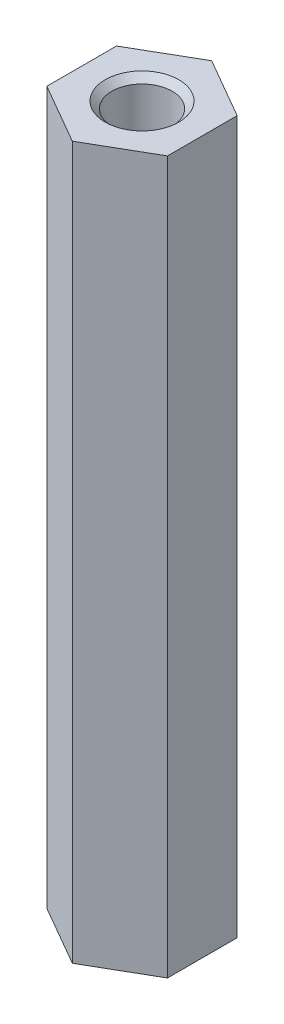
ISO-10303-21;
HEADER;
FILE_DESCRIPTION(('STEP AP214'),'2;1');
FILE_NAME('part.step','',(''),(''),'','','');
FILE_SCHEMA(('AUTOMOTIVE_DESIGN { 1 0 10303 214 1 1 1 1 }'));
ENDSEC;
DATA;
#1=APPLICATION_CONTEXT('core data for automotive mechanical design processes');
#2=APPLICATION_PROTOCOL_DEFINITION('international standard','automotive_design',2000,#1);
#3=PRODUCT_CONTEXT('',#1,'mechanical');
#4=PRODUCT('Part','Part','',(#3));
#5=PRODUCT_RELATED_PRODUCT_CATEGORY('part','',(#4));
#6=PRODUCT_DEFINITION_FORMATION('','',#4);
#7=PRODUCT_DEFINITION_CONTEXT('part definition',#1,'design');
#8=PRODUCT_DEFINITION('design','',#6,#7);
#9=PRODUCT_DEFINITION_SHAPE('','',#8);
#10=(LENGTH_UNIT() NAMED_UNIT(*) SI_UNIT(.MILLI.,.METRE.));
#11=(NAMED_UNIT(*) PLANE_ANGLE_UNIT() SI_UNIT($,.RADIAN.));
#12=(NAMED_UNIT(*) SI_UNIT($,.STERADIAN.) SOLID_ANGLE_UNIT());
#13=UNCERTAINTY_MEASURE_WITH_UNIT(LENGTH_MEASURE(1.E-05),#10,'distance_accuracy_value','');
#14=(GEOMETRIC_REPRESENTATION_CONTEXT(3) GLOBAL_UNCERTAINTY_ASSIGNED_CONTEXT((#13)) GLOBAL_UNIT_ASSIGNED_CONTEXT((#10,
#11,#12)) REPRESENTATION_CONTEXT('',''));
#15=CARTESIAN_POINT('',(0.,0.,0.));
#16=DIRECTION('',(0.,0.,1.));
#17=DIRECTION('',(1.,0.,0.));
#18=AXIS2_PLACEMENT_3D('',#15,#16,#17);
#19=CARTESIAN_POINT('',(0.,29.5,-2.88675134594813));
#20=DIRECTION('',(0.5,0.,0.866025403784439));
#21=DIRECTION('',(0.866025403784439,0.,-0.5));
#22=AXIS2_PLACEMENT_3D('',#19,#20,#21);
#23=PLANE('',#22);
#24=DIRECTION('',(-0.866025403784439,0.,0.5));
#25=VECTOR('',#24,1.);
#26=CARTESIAN_POINT('',(0.,0.,-2.88675134594813));
#27=LINE('',#26,#25);
#28=CARTESIAN_POINT('',(0.,0.,-2.88675134594813));
#29=VERTEX_POINT('',#28);
#30=CARTESIAN_POINT('',(-2.5,0.,-1.44337567297407));
#31=VERTEX_POINT('',#30);
#32=EDGE_CURVE('E129',#29,#31,#27,.T.);
#33=ORIENTED_EDGE('',*,*,#32,.T.);
#34=DIRECTION('',(0.,-1.,0.));
#35=VECTOR('',#34,1.);
#36=CARTESIAN_POINT('',(-2.5,29.5,-1.44337567297407));
#37=LINE('',#36,#35);
#38=CARTESIAN_POINT('',(-2.5,29.5,-1.44337567297407));
#39=VERTEX_POINT('',#38);
#40=EDGE_CURVE('E11',#39,#31,#37,.T.);
#41=ORIENTED_EDGE('',*,*,#40,.F.);
#42=DIRECTION('',(-0.866025403784439,0.,0.5));
#43=VECTOR('',#42,1.);
#44=CARTESIAN_POINT('',(0.,29.5,-2.88675134594813));
#45=LINE('',#44,#43);
#46=CARTESIAN_POINT('',(0.,29.5,-2.88675134594813));
#47=VERTEX_POINT('',#46);
#48=EDGE_CURVE('E140',#47,#39,#45,.T.);
#49=ORIENTED_EDGE('',*,*,#48,.F.);
#50=DIRECTION('',(0.,-1.,0.));
#51=VECTOR('',#50,1.);
#52=CARTESIAN_POINT('',(0.,29.5,-2.88675134594813));
#53=LINE('',#52,#51);
#54=EDGE_CURVE('E125',#47,#29,#53,.T.);
#55=ORIENTED_EDGE('',*,*,#54,.T.);
#56=EDGE_LOOP('',(#33,#41,#49,#55));
#57=FACE_BOUND('',#56,.T.);
#58=ADVANCED_FACE('F42',(#57),#23,.F.);
#59=CARTESIAN_POINT('',(-2.5,29.5,-1.44337567297407));
#60=DIRECTION('',(1.,0.,0.));
#61=DIRECTION('',(0.,0.,-1.));
#62=AXIS2_PLACEMENT_3D('',#59,#60,#61);
#63=PLANE('',#62);
#64=DIRECTION('',(0.,0.,1.));
#65=VECTOR('',#64,1.);
#66=CARTESIAN_POINT('',(-2.5,0.,-1.44337567297407));
#67=LINE('',#66,#65);
#68=CARTESIAN_POINT('',(-2.5,0.,1.44337567297406));
#69=VERTEX_POINT('',#68);
#70=EDGE_CURVE('E132',#31,#69,#67,.T.);
#71=ORIENTED_EDGE('',*,*,#70,.T.);
#72=DIRECTION('',(0.,-1.,0.));
#73=VECTOR('',#72,1.);
#74=CARTESIAN_POINT('',(-2.5,29.5,1.44337567297406));
#75=LINE('',#74,#73);
#76=CARTESIAN_POINT('',(-2.5,29.5,1.44337567297406));
#77=VERTEX_POINT('',#76);
#78=EDGE_CURVE('E50',#77,#69,#75,.T.);
#79=ORIENTED_EDGE('',*,*,#78,.F.);
#80=DIRECTION('',(0.,0.,1.));
#81=VECTOR('',#80,1.);
#82=CARTESIAN_POINT('',(-2.5,29.5,-1.44337567297407));
#83=LINE('',#82,#81);
#84=EDGE_CURVE('E96',#39,#77,#83,.T.);
#85=ORIENTED_EDGE('',*,*,#84,.F.);
#86=ORIENTED_EDGE('',*,*,#40,.T.);
#87=EDGE_LOOP('',(#71,#79,#85,#86));
#88=FACE_BOUND('',#87,.T.);
#89=ADVANCED_FACE('F165',(#88),#63,.F.);
#90=CARTESIAN_POINT('',(-2.5,29.5,1.44337567297406));
#91=DIRECTION('',(0.5,0.,-0.866025403784438));
#92=DIRECTION('',(-0.866025403784439,0.,-0.5));
#93=AXIS2_PLACEMENT_3D('',#90,#91,#92);
#94=PLANE('',#93);
#95=DIRECTION('',(0.866025403784438,0.,0.5));
#96=VECTOR('',#95,1.);
#97=CARTESIAN_POINT('',(-2.5,0.,1.44337567297406));
#98=LINE('',#97,#96);
#99=CARTESIAN_POINT('',(0.,0.,2.88675134594813));
#100=VERTEX_POINT('',#99);
#101=EDGE_CURVE('E135',#69,#100,#98,.T.);
#102=ORIENTED_EDGE('',*,*,#101,.T.);
#103=DIRECTION('',(0.,-1.,0.));
#104=VECTOR('',#103,1.);
#105=CARTESIAN_POINT('',(0.,29.5,2.88675134594813));
#106=LINE('',#105,#104);
#107=CARTESIAN_POINT('',(0.,29.5,2.88675134594813));
#108=VERTEX_POINT('',#107);
#109=EDGE_CURVE('E120',#108,#100,#106,.T.);
#110=ORIENTED_EDGE('',*,*,#109,.F.);
#111=DIRECTION('',(0.866025403784438,0.,0.5));
#112=VECTOR('',#111,1.);
#113=CARTESIAN_POINT('',(-2.5,29.5,1.44337567297406));
#114=LINE('',#113,#112);
#115=EDGE_CURVE('E111',#77,#108,#114,.T.);
#116=ORIENTED_EDGE('',*,*,#115,.F.);
#117=ORIENTED_EDGE('',*,*,#78,.T.);
#118=EDGE_LOOP('',(#102,#110,#116,#117));
#119=FACE_BOUND('',#118,.T.);
#120=ADVANCED_FACE('F146',(#119),#94,.F.);
#121=CARTESIAN_POINT('',(0.,29.5,2.88675134594813));
#122=DIRECTION('',(-0.5,0.,-0.866025403784439));
#123=DIRECTION('',(-0.866025403784439,0.,0.5));
#124=AXIS2_PLACEMENT_3D('',#121,#122,#123);
#125=PLANE('',#124);
#126=DIRECTION('',(0.866025403784438,0.,-0.5));
#127=VECTOR('',#126,1.);
#128=CARTESIAN_POINT('',(0.,0.,2.88675134594813));
#129=LINE('',#128,#127);
#130=CARTESIAN_POINT('',(2.5,0.,1.44337567297406));
#131=VERTEX_POINT('',#130);
#132=EDGE_CURVE('E119',#100,#131,#129,.T.);
#133=ORIENTED_EDGE('',*,*,#132,.T.);
#134=DIRECTION('',(0.,-1.,0.));
#135=VECTOR('',#134,1.);
#136=CARTESIAN_POINT('',(2.5,29.5,1.44337567297406));
#137=LINE('',#136,#135);
#138=CARTESIAN_POINT('',(2.5,29.5,1.44337567297406));
#139=VERTEX_POINT('',#138);
#140=EDGE_CURVE('E116',#139,#131,#137,.T.);
#141=ORIENTED_EDGE('',*,*,#140,.F.);
#142=DIRECTION('',(0.866025403784438,0.,-0.5));
#143=VECTOR('',#142,1.);
#144=CARTESIAN_POINT('',(0.,29.5,2.88675134594813));
#145=LINE('',#144,#143);
#146=EDGE_CURVE('E105',#108,#139,#145,.T.);
#147=ORIENTED_EDGE('',*,*,#146,.F.);
#148=ORIENTED_EDGE('',*,*,#109,.T.);
#149=EDGE_LOOP('',(#133,#141,#147,#148));
#150=FACE_BOUND('',#149,.T.);
#151=ADVANCED_FACE('F117',(#150),#125,.F.);
#152=CARTESIAN_POINT('',(2.5,29.5,1.44337567297406));
#153=DIRECTION('',(-1.,0.,0.));
#154=DIRECTION('',(0.,0.,1.));
#155=AXIS2_PLACEMENT_3D('',#152,#153,#154);
#156=PLANE('',#155);
#157=DIRECTION('',(0.,0.,-1.));
#158=VECTOR('',#157,1.);
#159=CARTESIAN_POINT('',(2.5,0.,1.44337567297406));
#160=LINE('',#159,#158);
#161=CARTESIAN_POINT('',(2.5,0.,-1.44337567297407));
#162=VERTEX_POINT('',#161);
#163=EDGE_CURVE('E82',#131,#162,#160,.T.);
#164=ORIENTED_EDGE('',*,*,#163,.T.);
#165=DIRECTION('',(0.,-1.,0.));
#166=VECTOR('',#165,1.);
#167=CARTESIAN_POINT('',(2.5,29.5,-1.44337567297407));
#168=LINE('',#167,#166);
#169=CARTESIAN_POINT('',(2.5,29.5,-1.44337567297407));
#170=VERTEX_POINT('',#169);
#171=EDGE_CURVE('E121',#170,#162,#168,.T.);
#172=ORIENTED_EDGE('',*,*,#171,.F.);
#173=DIRECTION('',(0.,0.,-1.));
#174=VECTOR('',#173,1.);
#175=CARTESIAN_POINT('',(2.5,29.5,1.44337567297406));
#176=LINE('',#175,#174);
#177=EDGE_CURVE('E109',#139,#170,#176,.T.);
#178=ORIENTED_EDGE('',*,*,#177,.F.);
#179=ORIENTED_EDGE('',*,*,#140,.T.);
#180=EDGE_LOOP('',(#164,#172,#178,#179));
#181=FACE_BOUND('',#180,.T.);
#182=ADVANCED_FACE('F123',(#181),#156,.F.);
#183=CARTESIAN_POINT('',(2.5,29.5,-1.44337567297407));
#184=DIRECTION('',(-0.5,0.,0.866025403784438));
#185=DIRECTION('',(0.866025403784439,0.,0.5));
#186=AXIS2_PLACEMENT_3D('',#183,#184,#185);
#187=PLANE('',#186);
#188=DIRECTION('',(-0.866025403784439,0.,-0.5));
#189=VECTOR('',#188,1.);
#190=CARTESIAN_POINT('',(2.5,0.,-1.44337567297407));
#191=LINE('',#190,#189);
#192=EDGE_CURVE('E88',#162,#29,#191,.T.);
#193=ORIENTED_EDGE('',*,*,#192,.T.);
#194=ORIENTED_EDGE('',*,*,#54,.F.);
#195=DIRECTION('',(-0.866025403784439,0.,-0.5));
#196=VECTOR('',#195,1.);
#197=CARTESIAN_POINT('',(2.5,29.5,-1.44337567297407));
#198=LINE('',#197,#196);
#199=EDGE_CURVE('E58',#170,#47,#198,.T.);
#200=ORIENTED_EDGE('',*,*,#199,.F.);
#201=ORIENTED_EDGE('',*,*,#171,.T.);
#202=EDGE_LOOP('',(#193,#194,#200,#201));
#203=FACE_BOUND('',#202,.T.);
#204=ADVANCED_FACE('F153',(#203),#187,.F.);
#205=CARTESIAN_POINT('',(0.,29.5,0.));
#206=DIRECTION('',(0.,1.,0.));
#207=DIRECTION('',(0.,0.,1.));
#208=AXIS2_PLACEMENT_3D('',#205,#206,#207);
#209=PLANE('',#208);
#210=CARTESIAN_POINT('',(0.,29.5,0.));
#211=DIRECTION('',(0.,1.,0.));
#212=DIRECTION('',(0.,0.,1.));
#213=AXIS2_PLACEMENT_3D('',#210,#211,#212);
#214=CIRCLE('',#213,1.525);
#215=CARTESIAN_POINT('',(0.,29.5,1.525));
#216=VERTEX_POINT('',#215);
#217=EDGE_CURVE('E294',#216,#216,#214,.T.);
#218=ORIENTED_EDGE('',*,*,#217,.F.);
#219=EDGE_LOOP('',(#218));
#220=FACE_BOUND('',#219,.T.);
#221=ORIENTED_EDGE('',*,*,#48,.T.);
#222=ORIENTED_EDGE('',*,*,#84,.T.);
#223=ORIENTED_EDGE('',*,*,#115,.T.);
#224=ORIENTED_EDGE('',*,*,#146,.T.);
#225=ORIENTED_EDGE('',*,*,#177,.T.);
#226=ORIENTED_EDGE('',*,*,#199,.T.);
#227=EDGE_LOOP('',(#221,#222,#223,#224,#225,#226));
#228=FACE_BOUND('',#227,.T.);
#229=ADVANCED_FACE('F107',(#220,#228),#209,.T.);
#230=CARTESIAN_POINT('',(0.,0.,0.));
#231=DIRECTION('',(0.,1.,0.));
#232=DIRECTION('',(0.,0.,1.));
#233=AXIS2_PLACEMENT_3D('',#230,#231,#232);
#234=PLANE('',#233);
#235=CARTESIAN_POINT('',(0.,0.,0.));
#236=DIRECTION('',(0.,-1.,0.));
#237=DIRECTION('',(0.,0.,-1.));
#238=AXIS2_PLACEMENT_3D('',#235,#236,#237);
#239=CIRCLE('',#238,1.525);
#240=CARTESIAN_POINT('',(0.,0.,-1.525));
#241=VERTEX_POINT('',#240);
#242=EDGE_CURVE('E287',#241,#241,#239,.T.);
#243=ORIENTED_EDGE('',*,*,#242,.F.);
#244=EDGE_LOOP('',(#243));
#245=FACE_BOUND('',#244,.T.);
#246=ORIENTED_EDGE('',*,*,#32,.F.);
#247=ORIENTED_EDGE('',*,*,#192,.F.);
#248=ORIENTED_EDGE('',*,*,#163,.F.);
#249=ORIENTED_EDGE('',*,*,#132,.F.);
#250=ORIENTED_EDGE('',*,*,#101,.F.);
#251=ORIENTED_EDGE('',*,*,#70,.F.);
#252=EDGE_LOOP('',(#246,#247,#248,#249,#250,#251));
#253=FACE_BOUND('',#252,.T.);
#254=ADVANCED_FACE('F149',(#245,#253),#234,.F.);
#255=CARTESIAN_POINT('',(0.,22.,0.));
#256=DIRECTION('',(0.,1.,0.));
#257=DIRECTION('',(0.,0.,1.));
#258=AXIS2_PLACEMENT_3D('',#255,#256,#257);
#259=CONICAL_SURFACE('',#258,1.25,1.02974425867665);
#260=CARTESIAN_POINT('',(0.,21.2489242262155,0.));
#261=VERTEX_POINT('',#260);
#262=VERTEX_LOOP('',#261);
#263=FACE_BOUND('',#262,.T.);
#264=CARTESIAN_POINT('',(0.,22.,0.));
#265=DIRECTION('',(0.,1.,0.));
#266=DIRECTION('',(0.,0.,1.));
#267=AXIS2_PLACEMENT_3D('',#264,#265,#266);
#268=CIRCLE('',#267,1.25);
#269=CARTESIAN_POINT('',(0.,22.,1.25));
#270=VERTEX_POINT('',#269);
#271=EDGE_CURVE('E133',#270,#270,#268,.T.);
#272=ORIENTED_EDGE('',*,*,#271,.T.);
#273=EDGE_LOOP('',(#272));
#274=FACE_BOUND('',#273,.T.);
#275=ADVANCED_FACE('F202',(#263,#274),#259,.F.);
#276=CARTESIAN_POINT('',(0.,29.5,0.));
#277=DIRECTION('',(0.,1.,0.));
#278=DIRECTION('',(0.,0.,1.));
#279=AXIS2_PLACEMENT_3D('',#276,#277,#278);
#280=CYLINDRICAL_SURFACE('',#279,1.25);
#281=ORIENTED_EDGE('',*,*,#271,.F.);
#282=EDGE_LOOP('',(#281));
#283=FACE_BOUND('',#282,.T.);
#284=CARTESIAN_POINT('',(0.,29.225,0.));
#285=DIRECTION('',(0.,1.,0.));
#286=DIRECTION('',(0.,0.,1.));
#287=AXIS2_PLACEMENT_3D('',#284,#285,#286);
#288=CIRCLE('',#287,1.25);
#289=CARTESIAN_POINT('',(0.,29.225,1.25));
#290=VERTEX_POINT('',#289);
#291=EDGE_CURVE('E297',#290,#290,#288,.T.);
#292=ORIENTED_EDGE('',*,*,#291,.T.);
#293=EDGE_LOOP('',(#292));
#294=FACE_BOUND('',#293,.T.);
#295=ADVANCED_FACE('F207',(#283,#294),#280,.F.);
#296=CARTESIAN_POINT('',(0.,29.5,0.));
#297=DIRECTION('',(0.,1.,0.));
#298=DIRECTION('',(0.,0.,1.));
#299=AXIS2_PLACEMENT_3D('',#296,#297,#298);
#300=CONICAL_SURFACE('',#299,1.525,0.785398163397448);
#301=ORIENTED_EDGE('',*,*,#291,.F.);
#302=EDGE_LOOP('',(#301));
#303=FACE_BOUND('',#302,.T.);
#304=ORIENTED_EDGE('',*,*,#217,.T.);
#305=EDGE_LOOP('',(#304));
#306=FACE_BOUND('',#305,.T.);
#307=ADVANCED_FACE('F219',(#303,#306),#300,.F.);
#308=CARTESIAN_POINT('',(0.,7.49999999999999,0.));
#309=DIRECTION('',(0.,-1.,0.));
#310=DIRECTION('',(0.,0.,-1.));
#311=AXIS2_PLACEMENT_3D('',#308,#309,#310);
#312=CONICAL_SURFACE('',#311,1.24999999999999,1.02974425867664);
#313=CARTESIAN_POINT('',(0.,8.25107577378445,0.));
#314=VERTEX_POINT('',#313);
#315=VERTEX_LOOP('',#314);
#316=FACE_BOUND('',#315,.T.);
#317=CARTESIAN_POINT('',(0.,7.49999999999999,0.));
#318=DIRECTION('',(0.,-1.,0.));
#319=DIRECTION('',(0.,0.,-1.));
#320=AXIS2_PLACEMENT_3D('',#317,#318,#319);
#321=CIRCLE('',#320,1.24999999999999);
#322=CARTESIAN_POINT('',(0.,7.49999999999999,-1.24999999999999));
#323=VERTEX_POINT('',#322);
#324=EDGE_CURVE('E289',#323,#323,#321,.T.);
#325=ORIENTED_EDGE('',*,*,#324,.T.);
#326=EDGE_LOOP('',(#325));
#327=FACE_BOUND('',#326,.T.);
#328=ADVANCED_FACE('F231',(#316,#327),#312,.F.);
#329=CARTESIAN_POINT('',(0.,0.,0.));
#330=DIRECTION('',(0.,-1.,0.));
#331=DIRECTION('',(0.,0.,-1.));
#332=AXIS2_PLACEMENT_3D('',#329,#330,#331);
#333=CYLINDRICAL_SURFACE('',#332,1.24999999999999);
#334=ORIENTED_EDGE('',*,*,#324,.F.);
#335=EDGE_LOOP('',(#334));
#336=FACE_BOUND('',#335,.T.);
#337=CARTESIAN_POINT('',(0.,0.274999999999997,0.));
#338=DIRECTION('',(0.,-1.,0.));
#339=DIRECTION('',(0.,0.,-1.));
#340=AXIS2_PLACEMENT_3D('',#337,#338,#339);
#341=CIRCLE('',#340,1.24999999999999);
#342=CARTESIAN_POINT('',(0.,0.274999999999997,-1.24999999999999));
#343=VERTEX_POINT('',#342);
#344=EDGE_CURVE('E284',#343,#343,#341,.T.);
#345=ORIENTED_EDGE('',*,*,#344,.T.);
#346=EDGE_LOOP('',(#345));
#347=FACE_BOUND('',#346,.T.);
#348=ADVANCED_FACE('F249',(#336,#347),#333,.F.);
#349=CARTESIAN_POINT('',(0.,0.,0.));
#350=DIRECTION('',(0.,-1.,0.));
#351=DIRECTION('',(0.,0.,-1.));
#352=AXIS2_PLACEMENT_3D('',#349,#350,#351);
#353=CONICAL_SURFACE('',#352,1.525,0.78539816339747);
#354=ORIENTED_EDGE('',*,*,#344,.F.);
#355=EDGE_LOOP('',(#354));
#356=FACE_BOUND('',#355,.T.);
#357=ORIENTED_EDGE('',*,*,#242,.T.);
#358=EDGE_LOOP('',(#357));
#359=FACE_BOUND('',#358,.T.);
#360=ADVANCED_FACE('F259',(#356,#359),#353,.F.);
#361=CLOSED_SHELL('',(#58,#89,#120,#151,#182,#204,#229,#254,#275,#295,#307,#328,#348,#360));
#362=MANIFOLD_SOLID_BREP('B2',#361);
#363=ADVANCED_BREP_SHAPE_REPRESENTATION('',(#18,#362),#14);
#364=SHAPE_DEFINITION_REPRESENTATION(#9,#363);
ENDSEC;
END-ISO-10303-21;
